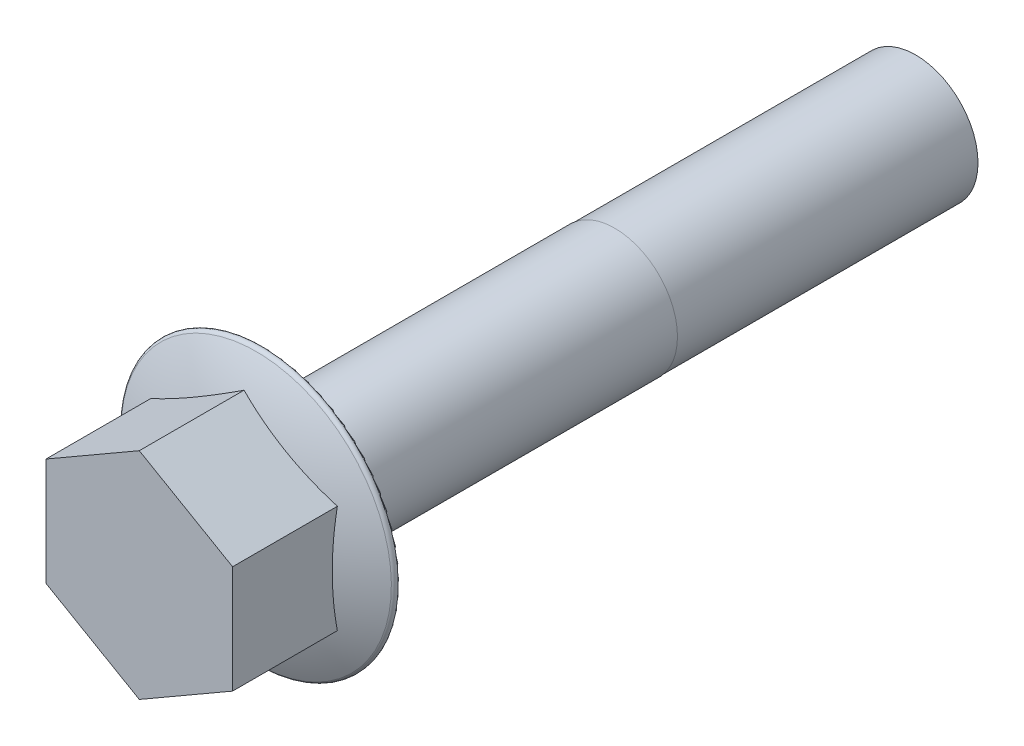
ISO-10303-21;
HEADER;
FILE_DESCRIPTION(('STEP AP214'),'2;1');
FILE_NAME('part.step','',(''),(''),'','','');
FILE_SCHEMA(('AUTOMOTIVE_DESIGN { 1 0 10303 214 1 1 1 1 }'));
ENDSEC;
DATA;
#1=APPLICATION_CONTEXT('core data for automotive mechanical design processes');
#2=APPLICATION_PROTOCOL_DEFINITION('international standard','automotive_design',2000,#1);
#3=PRODUCT_CONTEXT('',#1,'mechanical');
#4=PRODUCT('Part','Part','',(#3));
#5=PRODUCT_RELATED_PRODUCT_CATEGORY('part','',(#4));
#6=PRODUCT_DEFINITION_FORMATION('','',#4);
#7=PRODUCT_DEFINITION_CONTEXT('part definition',#1,'design');
#8=PRODUCT_DEFINITION('design','',#6,#7);
#9=PRODUCT_DEFINITION_SHAPE('','',#8);
#10=(LENGTH_UNIT() NAMED_UNIT(*) SI_UNIT(.MILLI.,.METRE.));
#11=(NAMED_UNIT(*) PLANE_ANGLE_UNIT() SI_UNIT($,.RADIAN.));
#12=(NAMED_UNIT(*) SI_UNIT($,.STERADIAN.) SOLID_ANGLE_UNIT());
#13=UNCERTAINTY_MEASURE_WITH_UNIT(LENGTH_MEASURE(1.E-05),#10,'distance_accuracy_value','');
#14=(GEOMETRIC_REPRESENTATION_CONTEXT(3) GLOBAL_UNCERTAINTY_ASSIGNED_CONTEXT((#13)) GLOBAL_UNIT_ASSIGNED_CONTEXT((#10,
#11,#12)) REPRESENTATION_CONTEXT('',''));
#15=CARTESIAN_POINT('',(0.,0.,0.));
#16=DIRECTION('',(0.,0.,1.));
#17=DIRECTION('',(1.,0.,0.));
#18=AXIS2_PLACEMENT_3D('',#15,#16,#17);
#19=CARTESIAN_POINT('',(0.,0.,-82.55));
#20=DIRECTION('',(0.,0.,1.));
#21=DIRECTION('',(1.,0.,0.));
#22=AXIS2_PLACEMENT_3D('',#19,#20,#21);
#23=CYLINDRICAL_SURFACE('',#22,7.9375);
#24=CARTESIAN_POINT('',(0.,0.,0.));
#25=DIRECTION('',(0.,0.,-1.));
#26=DIRECTION('',(-1.,0.,0.));
#27=AXIS2_PLACEMENT_3D('',#24,#25,#26);
#28=CIRCLE('',#27,7.9375);
#29=CARTESIAN_POINT('',(-7.9375,0.,0.));
#30=VERTEX_POINT('',#29);
#31=EDGE_CURVE('E40',#30,#30,#28,.T.);
#32=ORIENTED_EDGE('',*,*,#31,.T.);
#33=EDGE_LOOP('',(#32));
#34=FACE_BOUND('',#33,.T.);
#35=CARTESIAN_POINT('',(0.,0.,-44.45));
#36=DIRECTION('',(0.,0.,1.));
#37=DIRECTION('',(1.,0.,0.));
#38=AXIS2_PLACEMENT_3D('',#35,#36,#37);
#39=CIRCLE('',#38,7.93749999999999);
#40=CARTESIAN_POINT('',(7.93749999999999,0.,-44.45));
#41=VERTEX_POINT('',#40);
#42=EDGE_CURVE('E156',#41,#41,#39,.T.);
#43=ORIENTED_EDGE('',*,*,#42,.T.);
#44=EDGE_LOOP('',(#43));
#45=FACE_BOUND('',#44,.T.);
#46=ADVANCED_FACE('F32',(#34,#45),#23,.T.);
#47=CARTESIAN_POINT('',(0.,13.6381680587973,0.));
#48=DIRECTION('',(0.,0.,-1.));
#49=DIRECTION('',(-1.,0.,0.));
#50=AXIS2_PLACEMENT_3D('',#47,#48,#49);
#51=PLANE('',#50);
#52=ORIENTED_EDGE('',*,*,#31,.F.);
#53=EDGE_LOOP('',(#52));
#54=FACE_BOUND('',#53,.T.);
#55=CARTESIAN_POINT('',(0.,0.,0.));
#56=DIRECTION('',(0.,0.,-1.));
#57=DIRECTION('',(-1.,0.,0.));
#58=AXIS2_PLACEMENT_3D('',#55,#56,#57);
#59=CIRCLE('',#58,16.891);
#60=CARTESIAN_POINT('',(-16.891,0.,0.));
#61=VERTEX_POINT('',#60);
#62=EDGE_CURVE('E153',#61,#61,#59,.T.);
#63=ORIENTED_EDGE('',*,*,#62,.T.);
#64=EDGE_LOOP('',(#63));
#65=FACE_BOUND('',#64,.T.);
#66=ADVANCED_FACE('F180',(#54,#65),#51,.T.);
#67=CARTESIAN_POINT('',(0.,0.,-33.163235125));
#68=DIRECTION('',(0.,0.,-1.));
#69=DIRECTION('',(1.,0.,0.));
#70=AXIS2_PLACEMENT_3D('',#67,#68,#69);
#71=SPHERICAL_SURFACE('',#70,38.163235125);
#72=CARTESIAN_POINT('',(-5.90550000000003,10.2286260440979,-33.163235125));
#73=DIRECTION('',(-0.500000000000005,0.866025403784436,0.));
#74=DIRECTION('',(-0.866025403784436,-0.500000000000005,0.));
#75=AXIS2_PLACEMENT_3D('',#72,#73,#74);
#76=CIRCLE('',#75,36.2895686693302);
#77=CARTESIAN_POINT('',(0.,13.6381680587973,2.47989727390727));
#78=VERTEX_POINT('',#77);
#79=CARTESIAN_POINT('',(-11.8110000000001,6.81908402939851,2.47989727390727));
#80=VERTEX_POINT('',#79);
#81=EDGE_CURVE('E47',#78,#80,#76,.F.);
#82=ORIENTED_EDGE('',*,*,#81,.F.);
#83=CARTESIAN_POINT('',(5.90550000000007,10.2286260440979,-33.163235125));
#84=DIRECTION('',(0.50000000000001,0.866025403784433,0.));
#85=DIRECTION('',(-0.866025403784433,0.50000000000001,0.));
#86=AXIS2_PLACEMENT_3D('',#83,#84,#85);
#87=CIRCLE('',#86,36.2895686693302);
#88=CARTESIAN_POINT('',(11.8109999999999,6.81908402939851,2.47989727390732));
#89=VERTEX_POINT('',#88);
#90=EDGE_CURVE('E11',#89,#78,#87,.F.);
#91=ORIENTED_EDGE('',*,*,#90,.F.);
#92=CARTESIAN_POINT('',(11.8109999999999,0.,-33.163235125));
#93=DIRECTION('',(1.,0.,0.));
#94=DIRECTION('',(0.,1.,0.));
#95=AXIS2_PLACEMENT_3D('',#92,#93,#94);
#96=CIRCLE('',#95,36.2895686693302);
#97=CARTESIAN_POINT('',(11.8109999999999,-6.81908402939876,2.47989727390727));
#98=VERTEX_POINT('',#97);
#99=EDGE_CURVE('E85',#98,#89,#96,.F.);
#100=ORIENTED_EDGE('',*,*,#99,.F.);
#101=CARTESIAN_POINT('',(5.90549999999996,-10.228626044098,-33.163235125));
#102=DIRECTION('',(0.499999999999996,-0.866025403784441,0.));
#103=DIRECTION('',(0.866025403784441,0.499999999999996,0.));
#104=AXIS2_PLACEMENT_3D('',#101,#102,#103);
#105=CIRCLE('',#104,36.2895686693302);
#106=CARTESIAN_POINT('',(0.,-13.6381680587973,2.47989727390727));
#107=VERTEX_POINT('',#106);
#108=EDGE_CURVE('E97',#107,#98,#105,.F.);
#109=ORIENTED_EDGE('',*,*,#108,.F.);
#110=CARTESIAN_POINT('',(-5.90549999999992,-10.2286260440981,-33.163235125));
#111=DIRECTION('',(-0.499999999999991,-0.866025403784444,0.));
#112=DIRECTION('',(0.866025403784444,-0.499999999999991,0.));
#113=AXIS2_PLACEMENT_3D('',#110,#111,#112);
#114=CIRCLE('',#113,36.2895686693302);
#115=CARTESIAN_POINT('',(-11.8110000000001,-6.81908402939877,2.47989727390722));
#116=VERTEX_POINT('',#115);
#117=EDGE_CURVE('E136',#116,#107,#114,.F.);
#118=ORIENTED_EDGE('',*,*,#117,.F.);
#119=CARTESIAN_POINT('',(-11.8110000000001,0.,-33.163235125));
#120=DIRECTION('',(-1.,0.,0.));
#121=DIRECTION('',(0.,-1.,0.));
#122=AXIS2_PLACEMENT_3D('',#119,#120,#121);
#123=CIRCLE('',#122,36.2895686693302);
#124=EDGE_CURVE('E147',#80,#116,#123,.F.);
#125=ORIENTED_EDGE('',*,*,#124,.F.);
#126=EDGE_LOOP('',(#82,#91,#100,#109,#118,#125));
#127=FACE_BOUND('',#126,.T.);
#128=CARTESIAN_POINT('',(0.,0.,0.946897817105666));
#129=DIRECTION('',(0.,0.,-1.));
#130=DIRECTION('',(-1.,0.,0.));
#131=AXIS2_PLACEMENT_3D('',#128,#129,#130);
#132=CIRCLE('',#131,17.115237242817);
#133=CARTESIAN_POINT('',(-17.115237242817,0.,0.946897817105665));
#134=VERTEX_POINT('',#133);
#135=EDGE_CURVE('E98',#134,#134,#132,.T.);
#136=ORIENTED_EDGE('',*,*,#135,.F.);
#137=EDGE_LOOP('',(#136));
#138=FACE_BOUND('',#137,.T.);
#139=ADVANCED_FACE('F83',(#127,#138),#71,.T.);
#140=CARTESIAN_POINT('',(0.,0.,0.499999999999999));
#141=DIRECTION('',(0.,0.,-1.));
#142=DIRECTION('',(-1.,0.,0.));
#143=AXIS2_PLACEMENT_3D('',#140,#141,#142);
#144=TOROIDAL_SURFACE('',#143,16.891,0.499999999999997);
#145=ORIENTED_EDGE('',*,*,#135,.T.);
#146=EDGE_LOOP('',(#145));
#147=FACE_BOUND('',#146,.T.);
#148=ORIENTED_EDGE('',*,*,#62,.F.);
#149=EDGE_LOOP('',(#148));
#150=FACE_BOUND('',#149,.T.);
#151=ADVANCED_FACE('F190',(#147,#150),#144,.T.);
#152=CARTESIAN_POINT('',(0.,13.6381680587973,15.748));
#153=DIRECTION('',(0.,0.,-1.));
#154=DIRECTION('',(-1.,0.,0.));
#155=AXIS2_PLACEMENT_3D('',#152,#153,#154);
#156=PLANE('',#155);
#157=DIRECTION('',(0.866025403784435,0.500000000000005,0.));
#158=VECTOR('',#157,1.);
#159=CARTESIAN_POINT('',(-11.8110000000001,6.81908402939851,15.748));
#160=LINE('',#159,#158);
#161=CARTESIAN_POINT('',(-11.8110000000001,6.81908402939851,15.748));
#162=VERTEX_POINT('',#161);
#163=CARTESIAN_POINT('',(0.,13.6381680587973,15.748));
#164=VERTEX_POINT('',#163);
#165=EDGE_CURVE('E144',#162,#164,#160,.T.);
#166=ORIENTED_EDGE('',*,*,#165,.F.);
#167=DIRECTION('',(0.,1.,0.));
#168=VECTOR('',#167,1.);
#169=CARTESIAN_POINT('',(-11.8110000000001,-6.81908402939877,15.748));
#170=LINE('',#169,#168);
#171=CARTESIAN_POINT('',(-11.8110000000001,-6.81908402939877,15.748));
#172=VERTEX_POINT('',#171);
#173=EDGE_CURVE('E108',#172,#162,#170,.T.);
#174=ORIENTED_EDGE('',*,*,#173,.F.);
#175=DIRECTION('',(-0.866025403784444,0.499999999999991,0.));
#176=VECTOR('',#175,1.);
#177=CARTESIAN_POINT('',(0.,-13.6381680587973,15.748));
#178=LINE('',#177,#176);
#179=CARTESIAN_POINT('',(0.,-13.6381680587973,15.748));
#180=VERTEX_POINT('',#179);
#181=EDGE_CURVE('E134',#180,#172,#178,.T.);
#182=ORIENTED_EDGE('',*,*,#181,.F.);
#183=DIRECTION('',(-0.866025403784441,-0.499999999999996,0.));
#184=VECTOR('',#183,1.);
#185=CARTESIAN_POINT('',(11.8109999999999,-6.81908402939876,15.748));
#186=LINE('',#185,#184);
#187=CARTESIAN_POINT('',(11.8109999999999,-6.81908402939876,15.748));
#188=VERTEX_POINT('',#187);
#189=EDGE_CURVE('E128',#188,#180,#186,.T.);
#190=ORIENTED_EDGE('',*,*,#189,.F.);
#191=DIRECTION('',(0.,-1.,0.));
#192=VECTOR('',#191,1.);
#193=CARTESIAN_POINT('',(11.8109999999999,6.81908402939851,15.748));
#194=LINE('',#193,#192);
#195=CARTESIAN_POINT('',(11.8109999999999,6.81908402939851,15.748));
#196=VERTEX_POINT('',#195);
#197=EDGE_CURVE('E139',#196,#188,#194,.T.);
#198=ORIENTED_EDGE('',*,*,#197,.F.);
#199=DIRECTION('',(0.866025403784433,-0.50000000000001,0.));
#200=VECTOR('',#199,1.);
#201=CARTESIAN_POINT('',(0.,13.6381680587973,15.748));
#202=LINE('',#201,#200);
#203=EDGE_CURVE('E103',#164,#196,#202,.T.);
#204=ORIENTED_EDGE('',*,*,#203,.F.);
#205=EDGE_LOOP('',(#166,#174,#182,#190,#198,#204));
#206=FACE_BOUND('',#205,.T.);
#207=ADVANCED_FACE('F138',(#206),#156,.F.);
#208=CARTESIAN_POINT('',(0.,13.6381680587973,15.748));
#209=DIRECTION('',(0.50000000000001,0.866025403784433,0.));
#210=DIRECTION('',(-0.866025403784433,0.50000000000001,0.));
#211=AXIS2_PLACEMENT_3D('',#208,#209,#210);
#212=PLANE('',#211);
#213=DIRECTION('',(0.,0.,-1.));
#214=VECTOR('',#213,1.);
#215=CARTESIAN_POINT('',(11.8109999999999,6.81908402939851,15.748));
#216=LINE('',#215,#214);
#217=EDGE_CURVE('E94',#196,#89,#216,.T.);
#218=ORIENTED_EDGE('',*,*,#217,.T.);
#219=ORIENTED_EDGE('',*,*,#90,.T.);
#220=DIRECTION('',(0.,0.,-1.));
#221=VECTOR('',#220,1.);
#222=CARTESIAN_POINT('',(0.,13.6381680587973,15.748));
#223=LINE('',#222,#221);
#224=EDGE_CURVE('E104',#164,#78,#223,.T.);
#225=ORIENTED_EDGE('',*,*,#224,.F.);
#226=ORIENTED_EDGE('',*,*,#203,.T.);
#227=EDGE_LOOP('',(#218,#219,#225,#226));
#228=FACE_BOUND('',#227,.T.);
#229=ADVANCED_FACE('F101',(#228),#212,.T.);
#230=CARTESIAN_POINT('',(11.8109999999999,6.81908402939851,15.748));
#231=DIRECTION('',(1.,0.,0.));
#232=DIRECTION('',(0.,1.,0.));
#233=AXIS2_PLACEMENT_3D('',#230,#231,#232);
#234=PLANE('',#233);
#235=DIRECTION('',(0.,0.,-1.));
#236=VECTOR('',#235,1.);
#237=CARTESIAN_POINT('',(11.8109999999999,-6.81908402939876,15.748));
#238=LINE('',#237,#236);
#239=EDGE_CURVE('E96',#188,#98,#238,.T.);
#240=ORIENTED_EDGE('',*,*,#239,.T.);
#241=ORIENTED_EDGE('',*,*,#99,.T.);
#242=ORIENTED_EDGE('',*,*,#217,.F.);
#243=ORIENTED_EDGE('',*,*,#197,.T.);
#244=EDGE_LOOP('',(#240,#241,#242,#243));
#245=FACE_BOUND('',#244,.T.);
#246=ADVANCED_FACE('F92',(#245),#234,.T.);
#247=CARTESIAN_POINT('',(11.8109999999999,-6.81908402939876,15.748));
#248=DIRECTION('',(0.499999999999996,-0.866025403784441,0.));
#249=DIRECTION('',(0.866025403784441,0.499999999999996,0.));
#250=AXIS2_PLACEMENT_3D('',#247,#248,#249);
#251=PLANE('',#250);
#252=DIRECTION('',(0.,0.,-1.));
#253=VECTOR('',#252,1.);
#254=CARTESIAN_POINT('',(0.,-13.6381680587973,15.748));
#255=LINE('',#254,#253);
#256=EDGE_CURVE('E106',#180,#107,#255,.T.);
#257=ORIENTED_EDGE('',*,*,#256,.T.);
#258=ORIENTED_EDGE('',*,*,#108,.T.);
#259=ORIENTED_EDGE('',*,*,#239,.F.);
#260=ORIENTED_EDGE('',*,*,#189,.T.);
#261=EDGE_LOOP('',(#257,#258,#259,#260));
#262=FACE_BOUND('',#261,.T.);
#263=ADVANCED_FACE('F126',(#262),#251,.T.);
#264=CARTESIAN_POINT('',(0.,-13.6381680587973,15.748));
#265=DIRECTION('',(-0.499999999999991,-0.866025403784444,0.));
#266=DIRECTION('',(0.866025403784444,-0.499999999999991,0.));
#267=AXIS2_PLACEMENT_3D('',#264,#265,#266);
#268=PLANE('',#267);
#269=DIRECTION('',(0.,0.,-1.));
#270=VECTOR('',#269,1.);
#271=CARTESIAN_POINT('',(-11.8110000000001,-6.81908402939877,15.748));
#272=LINE('',#271,#270);
#273=EDGE_CURVE('E114',#172,#116,#272,.T.);
#274=ORIENTED_EDGE('',*,*,#273,.T.);
#275=ORIENTED_EDGE('',*,*,#117,.T.);
#276=ORIENTED_EDGE('',*,*,#256,.F.);
#277=ORIENTED_EDGE('',*,*,#181,.T.);
#278=EDGE_LOOP('',(#274,#275,#276,#277));
#279=FACE_BOUND('',#278,.T.);
#280=ADVANCED_FACE('F133',(#279),#268,.T.);
#281=CARTESIAN_POINT('',(-11.8110000000001,-6.81908402939877,15.748));
#282=DIRECTION('',(-1.,0.,0.));
#283=DIRECTION('',(0.,-1.,0.));
#284=AXIS2_PLACEMENT_3D('',#281,#282,#283);
#285=PLANE('',#284);
#286=DIRECTION('',(0.,0.,-1.));
#287=VECTOR('',#286,1.);
#288=CARTESIAN_POINT('',(-11.8110000000001,6.81908402939851,15.748));
#289=LINE('',#288,#287);
#290=EDGE_CURVE('E53',#162,#80,#289,.T.);
#291=ORIENTED_EDGE('',*,*,#290,.T.);
#292=ORIENTED_EDGE('',*,*,#124,.T.);
#293=ORIENTED_EDGE('',*,*,#273,.F.);
#294=ORIENTED_EDGE('',*,*,#173,.T.);
#295=EDGE_LOOP('',(#291,#292,#293,#294));
#296=FACE_BOUND('',#295,.T.);
#297=ADVANCED_FACE('F191',(#296),#285,.T.);
#298=CARTESIAN_POINT('',(-11.8110000000001,6.81908402939851,15.748));
#299=DIRECTION('',(-0.500000000000005,0.866025403784436,0.));
#300=DIRECTION('',(-0.866025403784436,-0.500000000000005,0.));
#301=AXIS2_PLACEMENT_3D('',#298,#299,#300);
#302=PLANE('',#301);
#303=ORIENTED_EDGE('',*,*,#224,.T.);
#304=ORIENTED_EDGE('',*,*,#81,.T.);
#305=ORIENTED_EDGE('',*,*,#290,.F.);
#306=ORIENTED_EDGE('',*,*,#165,.T.);
#307=EDGE_LOOP('',(#303,#304,#305,#306));
#308=FACE_BOUND('',#307,.T.);
#309=ADVANCED_FACE('F34',(#308),#302,.T.);
#310=CARTESIAN_POINT('',(0.,7.93749999999999,-44.45));
#311=DIRECTION('',(0.,0.,-1.));
#312=DIRECTION('',(-1.,0.,0.));
#313=AXIS2_PLACEMENT_3D('',#310,#311,#312);
#314=PLANE('',#313);
#315=CARTESIAN_POINT('',(0.,0.,-44.45));
#316=DIRECTION('',(0.,0.,1.));
#317=DIRECTION('',(1.,0.,0.));
#318=AXIS2_PLACEMENT_3D('',#315,#316,#317);
#319=CIRCLE('',#318,7.88749999999999);
#320=CARTESIAN_POINT('',(7.88749999999999,0.,-44.45));
#321=VERTEX_POINT('',#320);
#322=EDGE_CURVE('E159',#321,#321,#319,.T.);
#323=ORIENTED_EDGE('',*,*,#322,.T.);
#324=EDGE_LOOP('',(#323));
#325=FACE_BOUND('',#324,.T.);
#326=ORIENTED_EDGE('',*,*,#42,.F.);
#327=EDGE_LOOP('',(#326));
#328=FACE_BOUND('',#327,.T.);
#329=ADVANCED_FACE('F175',(#325,#328),#314,.T.);
#330=CARTESIAN_POINT('',(0.,0.,-21.5519356247289));
#331=DIRECTION('',(0.,0.,1.));
#332=DIRECTION('',(1.,0.,0.));
#333=AXIS2_PLACEMENT_3D('',#330,#331,#332);
#334=CYLINDRICAL_SURFACE('',#333,7.88749999999999);
#335=CARTESIAN_POINT('',(0.,0.,-82.55));
#336=DIRECTION('',(0.,0.,1.));
#337=DIRECTION('',(1.,0.,0.));
#338=AXIS2_PLACEMENT_3D('',#335,#336,#337);
#339=CIRCLE('',#338,7.88749999999999);
#340=CARTESIAN_POINT('',(7.88749999999999,0.,-82.55));
#341=VERTEX_POINT('',#340);
#342=EDGE_CURVE('E162',#341,#341,#339,.T.);
#343=ORIENTED_EDGE('',*,*,#342,.T.);
#344=EDGE_LOOP('',(#343));
#345=FACE_BOUND('',#344,.T.);
#346=ORIENTED_EDGE('',*,*,#322,.F.);
#347=EDGE_LOOP('',(#346));
#348=FACE_BOUND('',#347,.T.);
#349=ADVANCED_FACE('F166',(#345,#348),#334,.T.);
#350=CARTESIAN_POINT('',(0.,0.,-82.55));
#351=DIRECTION('',(0.,0.,1.));
#352=DIRECTION('',(1.,0.,0.));
#353=AXIS2_PLACEMENT_3D('',#350,#351,#352);
#354=PLANE('',#353);
#355=ORIENTED_EDGE('',*,*,#342,.F.);
#356=EDGE_LOOP('',(#355));
#357=FACE_BOUND('',#356,.T.);
#358=ADVANCED_FACE('F169',(#357),#354,.F.);
#359=CLOSED_SHELL('',(#46,#66,#139,#151,#207,#229,#246,#263,#280,#297,#309,#329,#349,#358));
#360=MANIFOLD_SOLID_BREP('B2',#359);
#361=ADVANCED_BREP_SHAPE_REPRESENTATION('',(#18,#360),#14);
#362=SHAPE_DEFINITION_REPRESENTATION(#9,#361);
ENDSEC;
END-ISO-10303-21;
